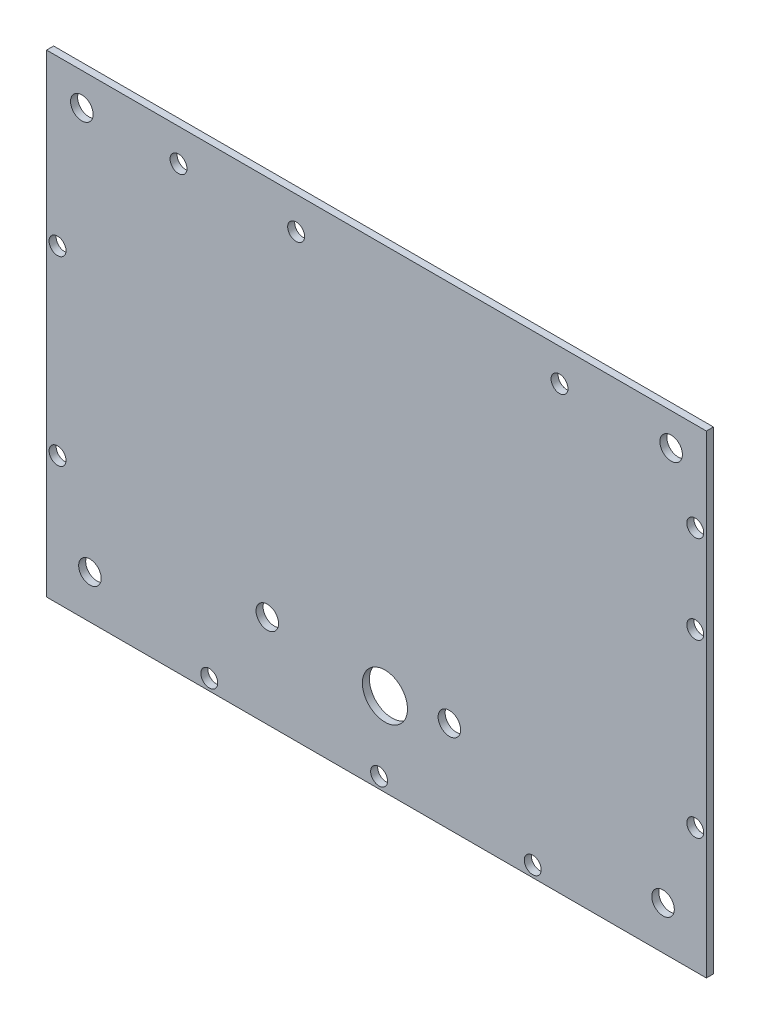
ISO-10303-21;
HEADER;
FILE_DESCRIPTION(('STEP AP214'),'2;1');
FILE_NAME('part.step','',(''),(''),'','','');
FILE_SCHEMA(('AUTOMOTIVE_DESIGN { 1 0 10303 214 1 1 1 1 }'));
ENDSEC;
DATA;
#1=APPLICATION_CONTEXT('core data for automotive mechanical design processes');
#2=APPLICATION_PROTOCOL_DEFINITION('international standard','automotive_design',2000,#1);
#3=PRODUCT_CONTEXT('',#1,'mechanical');
#4=PRODUCT('Part','Part','',(#3));
#5=PRODUCT_RELATED_PRODUCT_CATEGORY('part','',(#4));
#6=PRODUCT_DEFINITION_FORMATION('','',#4);
#7=PRODUCT_DEFINITION_CONTEXT('part definition',#1,'design');
#8=PRODUCT_DEFINITION('design','',#6,#7);
#9=PRODUCT_DEFINITION_SHAPE('','',#8);
#10=(LENGTH_UNIT() NAMED_UNIT(*) SI_UNIT(.MILLI.,.METRE.));
#11=(NAMED_UNIT(*) PLANE_ANGLE_UNIT() SI_UNIT($,.RADIAN.));
#12=(NAMED_UNIT(*) SI_UNIT($,.STERADIAN.) SOLID_ANGLE_UNIT());
#13=UNCERTAINTY_MEASURE_WITH_UNIT(LENGTH_MEASURE(1.E-05),#10,'distance_accuracy_value','');
#14=(GEOMETRIC_REPRESENTATION_CONTEXT(3) GLOBAL_UNCERTAINTY_ASSIGNED_CONTEXT((#13)) GLOBAL_UNIT_ASSIGNED_CONTEXT((#10,
#11,#12)) REPRESENTATION_CONTEXT('',''));
#15=CARTESIAN_POINT('',(0.,0.,0.));
#16=DIRECTION('',(0.,0.,1.));
#17=DIRECTION('',(1.,0.,0.));
#18=AXIS2_PLACEMENT_3D('',#15,#16,#17);
#19=CARTESIAN_POINT('',(74.295,-53.34,1.5875));
#20=DIRECTION('',(-1.,0.,0.));
#21=DIRECTION('',(0.,0.,1.));
#22=AXIS2_PLACEMENT_3D('',#19,#20,#21);
#23=PLANE('',#22);
#24=DIRECTION('',(0.,1.,0.));
#25=VECTOR('',#24,1.);
#26=CARTESIAN_POINT('',(74.295,-53.34,0.));
#27=LINE('',#26,#25);
#28=CARTESIAN_POINT('',(74.295,-53.34,0.));
#29=VERTEX_POINT('',#28);
#30=CARTESIAN_POINT('',(74.295,53.34,0.));
#31=VERTEX_POINT('',#30);
#32=EDGE_CURVE('E102',#29,#31,#27,.T.);
#33=ORIENTED_EDGE('',*,*,#32,.T.);
#34=DIRECTION('',(0.,0.,-1.));
#35=VECTOR('',#34,1.);
#36=CARTESIAN_POINT('',(74.295,53.34,1.5875));
#37=LINE('',#36,#35);
#38=CARTESIAN_POINT('',(74.295,53.34,1.5875));
#39=VERTEX_POINT('',#38);
#40=EDGE_CURVE('E11',#39,#31,#37,.T.);
#41=ORIENTED_EDGE('',*,*,#40,.F.);
#42=DIRECTION('',(0.,1.,0.));
#43=VECTOR('',#42,1.);
#44=CARTESIAN_POINT('',(74.295,-53.34,1.5875));
#45=LINE('',#44,#43);
#46=CARTESIAN_POINT('',(74.295,-53.34,1.5875));
#47=VERTEX_POINT('',#46);
#48=EDGE_CURVE('E90',#47,#39,#45,.T.);
#49=ORIENTED_EDGE('',*,*,#48,.F.);
#50=DIRECTION('',(0.,0.,-1.));
#51=VECTOR('',#50,1.);
#52=CARTESIAN_POINT('',(74.295,-53.34,1.5875));
#53=LINE('',#52,#51);
#54=EDGE_CURVE('E98',#47,#29,#53,.T.);
#55=ORIENTED_EDGE('',*,*,#54,.T.);
#56=EDGE_LOOP('',(#33,#41,#49,#55));
#57=FACE_BOUND('',#56,.T.);
#58=ADVANCED_FACE('F39',(#57),#23,.F.);
#59=CARTESIAN_POINT('',(-74.295,53.34,1.5875));
#60=DIRECTION('',(0.,-1.,0.));
#61=DIRECTION('',(0.,0.,-1.));
#62=AXIS2_PLACEMENT_3D('',#59,#60,#61);
#63=PLANE('',#62);
#64=DIRECTION('',(-1.,0.,0.));
#65=VECTOR('',#64,1.);
#66=CARTESIAN_POINT('',(-74.295,53.34,0.));
#67=LINE('',#66,#65);
#68=CARTESIAN_POINT('',(-74.295,53.34,0.));
#69=VERTEX_POINT('',#68);
#70=EDGE_CURVE('E94',#31,#69,#67,.T.);
#71=ORIENTED_EDGE('',*,*,#70,.T.);
#72=DIRECTION('',(0.,0.,-1.));
#73=VECTOR('',#72,1.);
#74=CARTESIAN_POINT('',(-74.295,53.34,1.5875));
#75=LINE('',#74,#73);
#76=CARTESIAN_POINT('',(-74.295,53.34,1.5875));
#77=VERTEX_POINT('',#76);
#78=EDGE_CURVE('E47',#77,#69,#75,.T.);
#79=ORIENTED_EDGE('',*,*,#78,.F.);
#80=DIRECTION('',(-1.,0.,0.));
#81=VECTOR('',#80,1.);
#82=CARTESIAN_POINT('',(-74.295,53.34,1.5875));
#83=LINE('',#82,#81);
#84=EDGE_CURVE('E85',#39,#77,#83,.T.);
#85=ORIENTED_EDGE('',*,*,#84,.F.);
#86=ORIENTED_EDGE('',*,*,#40,.T.);
#87=EDGE_LOOP('',(#71,#79,#85,#86));
#88=FACE_BOUND('',#87,.T.);
#89=ADVANCED_FACE('F93',(#88),#63,.F.);
#90=CARTESIAN_POINT('',(-74.295,-53.34,1.5875));
#91=DIRECTION('',(1.,0.,0.));
#92=DIRECTION('',(0.,0.,-1.));
#93=AXIS2_PLACEMENT_3D('',#90,#91,#92);
#94=PLANE('',#93);
#95=DIRECTION('',(0.,-1.,0.));
#96=VECTOR('',#95,1.);
#97=CARTESIAN_POINT('',(-74.295,-53.34,0.));
#98=LINE('',#97,#96);
#99=CARTESIAN_POINT('',(-74.295,-53.34,0.));
#100=VERTEX_POINT('',#99);
#101=EDGE_CURVE('E72',#69,#100,#98,.T.);
#102=ORIENTED_EDGE('',*,*,#101,.T.);
#103=DIRECTION('',(0.,0.,-1.));
#104=VECTOR('',#103,1.);
#105=CARTESIAN_POINT('',(-74.295,-53.34,1.5875));
#106=LINE('',#105,#104);
#107=CARTESIAN_POINT('',(-74.295,-53.34,1.5875));
#108=VERTEX_POINT('',#107);
#109=EDGE_CURVE('E95',#108,#100,#106,.T.);
#110=ORIENTED_EDGE('',*,*,#109,.F.);
#111=DIRECTION('',(0.,-1.,0.));
#112=VECTOR('',#111,1.);
#113=CARTESIAN_POINT('',(-74.295,-53.34,1.5875));
#114=LINE('',#113,#112);
#115=EDGE_CURVE('E88',#77,#108,#114,.T.);
#116=ORIENTED_EDGE('',*,*,#115,.F.);
#117=ORIENTED_EDGE('',*,*,#78,.T.);
#118=EDGE_LOOP('',(#102,#110,#116,#117));
#119=FACE_BOUND('',#118,.T.);
#120=ADVANCED_FACE('F96',(#119),#94,.F.);
#121=CARTESIAN_POINT('',(-74.295,-53.34,1.5875));
#122=DIRECTION('',(0.,1.,0.));
#123=DIRECTION('',(0.,0.,1.));
#124=AXIS2_PLACEMENT_3D('',#121,#122,#123);
#125=PLANE('',#124);
#126=DIRECTION('',(1.,0.,0.));
#127=VECTOR('',#126,1.);
#128=CARTESIAN_POINT('',(-74.295,-53.34,0.));
#129=LINE('',#128,#127);
#130=EDGE_CURVE('E78',#100,#29,#129,.T.);
#131=ORIENTED_EDGE('',*,*,#130,.T.);
#132=ORIENTED_EDGE('',*,*,#54,.F.);
#133=DIRECTION('',(1.,0.,0.));
#134=VECTOR('',#133,1.);
#135=CARTESIAN_POINT('',(-74.295,-53.34,1.5875));
#136=LINE('',#135,#134);
#137=EDGE_CURVE('E55',#108,#47,#136,.T.);
#138=ORIENTED_EDGE('',*,*,#137,.F.);
#139=ORIENTED_EDGE('',*,*,#109,.T.);
#140=EDGE_LOOP('',(#131,#132,#138,#139));
#141=FACE_BOUND('',#140,.T.);
#142=ADVANCED_FACE('F110',(#141),#125,.F.);
#143=CARTESIAN_POINT('',(0.,0.,1.5875));
#144=DIRECTION('',(0.,0.,-1.));
#145=DIRECTION('',(-1.,0.,0.));
#146=AXIS2_PLACEMENT_3D('',#143,#144,#145);
#147=PLANE('',#146);
#148=CARTESIAN_POINT('',(-24.5848329268184,-32.4093144095199,1.5875));
#149=DIRECTION('',(0.,0.,1.));
#150=DIRECTION('',(1.,0.,0.));
#151=AXIS2_PLACEMENT_3D('',#148,#149,#150);
#152=CIRCLE('',#151,2.54);
#153=CARTESIAN_POINT('',(-22.0448329268184,-32.4093144095199,1.5875));
#154=VERTEX_POINT('',#153);
#155=EDGE_CURVE('E156',#154,#154,#152,.T.);
#156=ORIENTED_EDGE('',*,*,#155,.F.);
#157=EDGE_LOOP('',(#156));
#158=FACE_BOUND('',#157,.T.);
#159=CARTESIAN_POINT('',(16.415053575909,-32.6176478408348,1.5875));
#160=DIRECTION('',(0.,0.,1.));
#161=DIRECTION('',(1.,0.,0.));
#162=AXIS2_PLACEMENT_3D('',#159,#160,#161);
#163=CIRCLE('',#162,2.54);
#164=CARTESIAN_POINT('',(18.955053575909,-32.6176478408348,1.5875));
#165=VERTEX_POINT('',#164);
#166=EDGE_CURVE('E215',#165,#165,#163,.T.);
#167=ORIENTED_EDGE('',*,*,#166,.F.);
#168=EDGE_LOOP('',(#167));
#169=FACE_BOUND('',#168,.T.);
#170=CARTESIAN_POINT('',(-71.823750006,16.3856887750996,1.5875));
#171=DIRECTION('',(0.,0.,1.));
#172=DIRECTION('',(1.,0.,0.));
#173=AXIS2_PLACEMENT_3D('',#170,#171,#172);
#174=CIRCLE('',#173,1.90499999999999);
#175=CARTESIAN_POINT('',(-69.918750006,16.3856887750996,1.5875));
#176=VERTEX_POINT('',#175);
#177=EDGE_CURVE('E155',#176,#176,#174,.T.);
#178=ORIENTED_EDGE('',*,*,#177,.F.);
#179=EDGE_LOOP('',(#178));
#180=FACE_BOUND('',#179,.T.);
#181=CARTESIAN_POINT('',(-71.823750006,-24.5174857949194,1.5875));
#182=DIRECTION('',(0.,0.,1.));
#183=DIRECTION('',(1.,0.,0.));
#184=AXIS2_PLACEMENT_3D('',#181,#182,#183);
#185=CIRCLE('',#184,1.90499999999999);
#186=CARTESIAN_POINT('',(-69.918750006,-24.5174857949194,1.5875));
#187=VERTEX_POINT('',#186);
#188=EDGE_CURVE('E162',#187,#187,#185,.T.);
#189=ORIENTED_EDGE('',*,*,#188,.F.);
#190=EDGE_LOOP('',(#189));
#191=FACE_BOUND('',#190,.T.);
#192=CARTESIAN_POINT('',(-37.6554621700565,-50.84,1.5875));
#193=DIRECTION('',(0.,0.,1.));
#194=DIRECTION('',(1.,0.,0.));
#195=AXIS2_PLACEMENT_3D('',#192,#193,#194);
#196=CIRCLE('',#195,1.905);
#197=CARTESIAN_POINT('',(-35.7504621700565,-50.84,1.5875));
#198=VERTEX_POINT('',#197);
#199=EDGE_CURVE('E168',#198,#198,#196,.T.);
#200=ORIENTED_EDGE('',*,*,#199,.F.);
#201=EDGE_LOOP('',(#200));
#202=FACE_BOUND('',#201,.T.);
#203=CARTESIAN_POINT('',(0.592258220454889,-50.84,1.5875));
#204=DIRECTION('',(0.,0.,1.));
#205=DIRECTION('',(1.,0.,0.));
#206=AXIS2_PLACEMENT_3D('',#203,#204,#205);
#207=CIRCLE('',#206,1.905);
#208=CARTESIAN_POINT('',(2.49725822045489,-50.84,1.5875));
#209=VERTEX_POINT('',#208);
#210=EDGE_CURVE('E174',#209,#209,#207,.T.);
#211=ORIENTED_EDGE('',*,*,#210,.F.);
#212=EDGE_LOOP('',(#211));
#213=FACE_BOUND('',#212,.T.);
#214=CARTESIAN_POINT('',(35.1973818774609,-50.84,1.5875));
#215=DIRECTION('',(0.,0.,1.));
#216=DIRECTION('',(1.,0.,0.));
#217=AXIS2_PLACEMENT_3D('',#214,#215,#216);
#218=CIRCLE('',#217,1.905);
#219=CARTESIAN_POINT('',(37.1023818774609,-50.84,1.5875));
#220=VERTEX_POINT('',#219);
#221=EDGE_CURVE('E180',#220,#220,#218,.T.);
#222=ORIENTED_EDGE('',*,*,#221,.F.);
#223=EDGE_LOOP('',(#222));
#224=FACE_BOUND('',#223,.T.);
#225=CARTESIAN_POINT('',(71.795,-25.2459068015326,1.5875));
#226=DIRECTION('',(0.,0.,1.));
#227=DIRECTION('',(1.,0.,0.));
#228=AXIS2_PLACEMENT_3D('',#225,#226,#227);
#229=CIRCLE('',#228,1.90500000000001);
#230=CARTESIAN_POINT('',(73.7,-25.2459068015326,1.5875));
#231=VERTEX_POINT('',#230);
#232=EDGE_CURVE('E186',#231,#231,#229,.T.);
#233=ORIENTED_EDGE('',*,*,#232,.F.);
#234=EDGE_LOOP('',(#233));
#235=FACE_BOUND('',#234,.T.);
#236=CARTESIAN_POINT('',(71.795,13.3752433604116,1.5875));
#237=DIRECTION('',(0.,0.,1.));
#238=DIRECTION('',(1.,0.,0.));
#239=AXIS2_PLACEMENT_3D('',#236,#237,#238);
#240=CIRCLE('',#239,1.90500000000001);
#241=CARTESIAN_POINT('',(73.7,13.3752433604116,1.5875));
#242=VERTEX_POINT('',#241);
#243=EDGE_CURVE('E192',#242,#242,#240,.T.);
#244=ORIENTED_EDGE('',*,*,#243,.F.);
#245=EDGE_LOOP('',(#244));
#246=FACE_BOUND('',#245,.T.);
#247=CARTESIAN_POINT('',(71.795,33.1996804154614,1.5875));
#248=DIRECTION('',(0.,0.,1.));
#249=DIRECTION('',(1.,0.,0.));
#250=AXIS2_PLACEMENT_3D('',#247,#248,#249);
#251=CIRCLE('',#250,1.90500000000001);
#252=CARTESIAN_POINT('',(73.7,33.1996804154614,1.5875));
#253=VERTEX_POINT('',#252);
#254=EDGE_CURVE('E198',#253,#253,#251,.T.);
#255=ORIENTED_EDGE('',*,*,#254,.F.);
#256=EDGE_LOOP('',(#255));
#257=FACE_BOUND('',#256,.T.);
#258=CARTESIAN_POINT('',(41.2226177446453,46.0169346163496,1.5875));
#259=DIRECTION('',(0.,0.,1.));
#260=DIRECTION('',(1.,0.,0.));
#261=AXIS2_PLACEMENT_3D('',#258,#259,#260);
#262=CIRCLE('',#261,1.905);
#263=CARTESIAN_POINT('',(43.1276177446453,46.0169346163496,1.5875));
#264=VERTEX_POINT('',#263);
#265=EDGE_CURVE('E204',#264,#264,#262,.T.);
#266=ORIENTED_EDGE('',*,*,#265,.F.);
#267=EDGE_LOOP('',(#266));
#268=FACE_BOUND('',#267,.T.);
#269=CARTESIAN_POINT('',(-18.0962742555855,46.0169346163496,1.5875));
#270=DIRECTION('',(0.,0.,1.));
#271=DIRECTION('',(1.,0.,0.));
#272=AXIS2_PLACEMENT_3D('',#269,#270,#271);
#273=CIRCLE('',#272,1.90500000000001);
#274=CARTESIAN_POINT('',(-16.1912742555854,46.0169346163496,1.5875));
#275=VERTEX_POINT('',#274);
#276=EDGE_CURVE('E149',#275,#275,#273,.T.);
#277=ORIENTED_EDGE('',*,*,#276,.F.);
#278=EDGE_LOOP('',(#277));
#279=FACE_BOUND('',#278,.T.);
#280=CARTESIAN_POINT('',(-44.5785823419475,46.0169346163496,1.5875));
#281=DIRECTION('',(0.,0.,1.));
#282=DIRECTION('',(1.,0.,0.));
#283=AXIS2_PLACEMENT_3D('',#280,#281,#282);
#284=CIRCLE('',#283,1.90500000000001);
#285=CARTESIAN_POINT('',(-42.6735823419475,46.0169346163496,1.5875));
#286=VERTEX_POINT('',#285);
#287=EDGE_CURVE('E143',#286,#286,#284,.T.);
#288=ORIENTED_EDGE('',*,*,#287,.F.);
#289=EDGE_LOOP('',(#288));
#290=FACE_BOUND('',#289,.T.);
#291=CARTESIAN_POINT('',(1.90499999999999,-34.544,1.5875));
#292=DIRECTION('',(0.,0.,1.));
#293=DIRECTION('',(1.,0.,0.));
#294=AXIS2_PLACEMENT_3D('',#291,#292,#293);
#295=CIRCLE('',#294,5.08);
#296=CARTESIAN_POINT('',(6.98499999999999,-34.544,1.5875));
#297=VERTEX_POINT('',#296);
#298=EDGE_CURVE('E137',#297,#297,#295,.T.);
#299=ORIENTED_EDGE('',*,*,#298,.F.);
#300=EDGE_LOOP('',(#299));
#301=FACE_BOUND('',#300,.T.);
#302=CARTESIAN_POINT('',(64.5325,-43.5775,1.5875));
#303=DIRECTION('',(0.,0.,1.));
#304=DIRECTION('',(-1.,0.,0.));
#305=AXIS2_PLACEMENT_3D('',#302,#303,#304);
#306=CIRCLE('',#305,2.54);
#307=CARTESIAN_POINT('',(61.9925,-43.5775,1.5875));
#308=VERTEX_POINT('',#307);
#309=EDGE_CURVE('E129',#308,#308,#306,.T.);
#310=ORIENTED_EDGE('',*,*,#309,.F.);
#311=EDGE_LOOP('',(#310));
#312=FACE_BOUND('',#311,.T.);
#313=CARTESIAN_POINT('',(-66.3575,46.0375,1.5875));
#314=DIRECTION('',(0.,0.,1.));
#315=DIRECTION('',(1.,0.,0.));
#316=AXIS2_PLACEMENT_3D('',#313,#314,#315);
#317=CIRCLE('',#316,2.54);
#318=CARTESIAN_POINT('',(-63.8175,46.0375,1.5875));
#319=VERTEX_POINT('',#318);
#320=EDGE_CURVE('E122',#319,#319,#317,.T.);
#321=ORIENTED_EDGE('',*,*,#320,.F.);
#322=EDGE_LOOP('',(#321));
#323=FACE_BOUND('',#322,.T.);
#324=CARTESIAN_POINT('',(66.3575,46.0375,1.5875));
#325=DIRECTION('',(0.,0.,1.));
#326=DIRECTION('',(-1.,0.,0.));
#327=AXIS2_PLACEMENT_3D('',#324,#325,#326);
#328=CIRCLE('',#327,2.54);
#329=CARTESIAN_POINT('',(63.8175,46.0375,1.5875));
#330=VERTEX_POINT('',#329);
#331=EDGE_CURVE('E134',#330,#330,#328,.T.);
#332=ORIENTED_EDGE('',*,*,#331,.F.);
#333=EDGE_LOOP('',(#332));
#334=FACE_BOUND('',#333,.T.);
#335=CARTESIAN_POINT('',(-64.5325,-43.5775,1.5875));
#336=DIRECTION('',(0.,0.,1.));
#337=DIRECTION('',(1.,0.,0.));
#338=AXIS2_PLACEMENT_3D('',#335,#336,#337);
#339=CIRCLE('',#338,2.54);
#340=CARTESIAN_POINT('',(-61.9925,-43.5775,1.5875));
#341=VERTEX_POINT('',#340);
#342=EDGE_CURVE('E116',#341,#341,#339,.T.);
#343=ORIENTED_EDGE('',*,*,#342,.F.);
#344=EDGE_LOOP('',(#343));
#345=FACE_BOUND('',#344,.T.);
#346=ORIENTED_EDGE('',*,*,#48,.T.);
#347=ORIENTED_EDGE('',*,*,#84,.T.);
#348=ORIENTED_EDGE('',*,*,#115,.T.);
#349=ORIENTED_EDGE('',*,*,#137,.T.);
#350=EDGE_LOOP('',(#346,#347,#348,#349));
#351=FACE_BOUND('',#350,.T.);
#352=ADVANCED_FACE('F86',(#158,#169,#180,#191,#202,#213,#224,#235,#246,#257,#268,#279,#290,#301,
#312,#323,#334,#345,#351),#147,.F.);
#353=CARTESIAN_POINT('',(0.,0.,0.));
#354=DIRECTION('',(0.,0.,-1.));
#355=DIRECTION('',(-1.,0.,0.));
#356=AXIS2_PLACEMENT_3D('',#353,#354,#355);
#357=PLANE('',#356);
#358=CARTESIAN_POINT('',(-24.5848329268184,-32.4093144095199,0.));
#359=DIRECTION('',(0.,0.,-1.));
#360=DIRECTION('',(-1.,0.,0.));
#361=AXIS2_PLACEMENT_3D('',#358,#359,#360);
#362=CIRCLE('',#361,2.54);
#363=CARTESIAN_POINT('',(-27.1248329268184,-32.4093144095199,0.));
#364=VERTEX_POINT('',#363);
#365=EDGE_CURVE('E218',#364,#364,#362,.F.);
#366=ORIENTED_EDGE('',*,*,#365,.T.);
#367=EDGE_LOOP('',(#366));
#368=FACE_BOUND('',#367,.T.);
#369=CARTESIAN_POINT('',(16.415053575909,-32.6176478408348,0.));
#370=DIRECTION('',(0.,0.,-1.));
#371=DIRECTION('',(-1.,0.,0.));
#372=AXIS2_PLACEMENT_3D('',#369,#370,#371);
#373=CIRCLE('',#372,2.54);
#374=CARTESIAN_POINT('',(13.875053575909,-32.6176478408348,0.));
#375=VERTEX_POINT('',#374);
#376=EDGE_CURVE('E212',#375,#375,#373,.F.);
#377=ORIENTED_EDGE('',*,*,#376,.T.);
#378=EDGE_LOOP('',(#377));
#379=FACE_BOUND('',#378,.T.);
#380=CARTESIAN_POINT('',(-71.823750006,16.3856887750996,0.));
#381=DIRECTION('',(0.,0.,-1.));
#382=DIRECTION('',(-1.,0.,0.));
#383=AXIS2_PLACEMENT_3D('',#380,#381,#382);
#384=CIRCLE('',#383,1.90499999999999);
#385=CARTESIAN_POINT('',(-73.7287500059999,16.3856887750996,0.));
#386=VERTEX_POINT('',#385);
#387=EDGE_CURVE('E152',#386,#386,#384,.F.);
#388=ORIENTED_EDGE('',*,*,#387,.T.);
#389=EDGE_LOOP('',(#388));
#390=FACE_BOUND('',#389,.T.);
#391=CARTESIAN_POINT('',(-71.823750006,-24.5174857949194,0.));
#392=DIRECTION('',(0.,0.,-1.));
#393=DIRECTION('',(-1.,0.,0.));
#394=AXIS2_PLACEMENT_3D('',#391,#392,#393);
#395=CIRCLE('',#394,1.90499999999999);
#396=CARTESIAN_POINT('',(-73.7287500059999,-24.5174857949194,0.));
#397=VERTEX_POINT('',#396);
#398=EDGE_CURVE('E159',#397,#397,#395,.F.);
#399=ORIENTED_EDGE('',*,*,#398,.T.);
#400=EDGE_LOOP('',(#399));
#401=FACE_BOUND('',#400,.T.);
#402=CARTESIAN_POINT('',(-37.6554621700565,-50.84,0.));
#403=DIRECTION('',(0.,0.,-1.));
#404=DIRECTION('',(-1.,0.,0.));
#405=AXIS2_PLACEMENT_3D('',#402,#403,#404);
#406=CIRCLE('',#405,1.905);
#407=CARTESIAN_POINT('',(-39.5604621700565,-50.84,0.));
#408=VERTEX_POINT('',#407);
#409=EDGE_CURVE('E165',#408,#408,#406,.F.);
#410=ORIENTED_EDGE('',*,*,#409,.T.);
#411=EDGE_LOOP('',(#410));
#412=FACE_BOUND('',#411,.T.);
#413=CARTESIAN_POINT('',(0.592258220454889,-50.84,0.));
#414=DIRECTION('',(0.,0.,-1.));
#415=DIRECTION('',(-1.,0.,0.));
#416=AXIS2_PLACEMENT_3D('',#413,#414,#415);
#417=CIRCLE('',#416,1.905);
#418=CARTESIAN_POINT('',(-1.31274177954512,-50.84,0.));
#419=VERTEX_POINT('',#418);
#420=EDGE_CURVE('E171',#419,#419,#417,.F.);
#421=ORIENTED_EDGE('',*,*,#420,.T.);
#422=EDGE_LOOP('',(#421));
#423=FACE_BOUND('',#422,.T.);
#424=CARTESIAN_POINT('',(35.1973818774609,-50.84,0.));
#425=DIRECTION('',(0.,0.,-1.));
#426=DIRECTION('',(-1.,0.,0.));
#427=AXIS2_PLACEMENT_3D('',#424,#425,#426);
#428=CIRCLE('',#427,1.905);
#429=CARTESIAN_POINT('',(33.2923818774609,-50.84,0.));
#430=VERTEX_POINT('',#429);
#431=EDGE_CURVE('E177',#430,#430,#428,.F.);
#432=ORIENTED_EDGE('',*,*,#431,.T.);
#433=EDGE_LOOP('',(#432));
#434=FACE_BOUND('',#433,.T.);
#435=CARTESIAN_POINT('',(71.795,-25.2459068015326,0.));
#436=DIRECTION('',(0.,0.,-1.));
#437=DIRECTION('',(-1.,0.,0.));
#438=AXIS2_PLACEMENT_3D('',#435,#436,#437);
#439=CIRCLE('',#438,1.90500000000001);
#440=CARTESIAN_POINT('',(69.89,-25.2459068015326,0.));
#441=VERTEX_POINT('',#440);
#442=EDGE_CURVE('E183',#441,#441,#439,.F.);
#443=ORIENTED_EDGE('',*,*,#442,.T.);
#444=EDGE_LOOP('',(#443));
#445=FACE_BOUND('',#444,.T.);
#446=CARTESIAN_POINT('',(71.795,13.3752433604116,0.));
#447=DIRECTION('',(0.,0.,-1.));
#448=DIRECTION('',(-1.,0.,0.));
#449=AXIS2_PLACEMENT_3D('',#446,#447,#448);
#450=CIRCLE('',#449,1.90500000000001);
#451=CARTESIAN_POINT('',(69.89,13.3752433604116,0.));
#452=VERTEX_POINT('',#451);
#453=EDGE_CURVE('E189',#452,#452,#450,.F.);
#454=ORIENTED_EDGE('',*,*,#453,.T.);
#455=EDGE_LOOP('',(#454));
#456=FACE_BOUND('',#455,.T.);
#457=CARTESIAN_POINT('',(71.795,33.1996804154614,0.));
#458=DIRECTION('',(0.,0.,-1.));
#459=DIRECTION('',(-1.,0.,0.));
#460=AXIS2_PLACEMENT_3D('',#457,#458,#459);
#461=CIRCLE('',#460,1.90500000000001);
#462=CARTESIAN_POINT('',(69.89,33.1996804154614,0.));
#463=VERTEX_POINT('',#462);
#464=EDGE_CURVE('E195',#463,#463,#461,.F.);
#465=ORIENTED_EDGE('',*,*,#464,.T.);
#466=EDGE_LOOP('',(#465));
#467=FACE_BOUND('',#466,.T.);
#468=CARTESIAN_POINT('',(41.2226177446453,46.0169346163496,0.));
#469=DIRECTION('',(0.,0.,-1.));
#470=DIRECTION('',(-1.,0.,0.));
#471=AXIS2_PLACEMENT_3D('',#468,#469,#470);
#472=CIRCLE('',#471,1.905);
#473=CARTESIAN_POINT('',(39.3176177446453,46.0169346163496,0.));
#474=VERTEX_POINT('',#473);
#475=EDGE_CURVE('E201',#474,#474,#472,.F.);
#476=ORIENTED_EDGE('',*,*,#475,.T.);
#477=EDGE_LOOP('',(#476));
#478=FACE_BOUND('',#477,.T.);
#479=CARTESIAN_POINT('',(-18.0962742555855,46.0169346163496,0.));
#480=DIRECTION('',(0.,0.,-1.));
#481=DIRECTION('',(-1.,0.,0.));
#482=AXIS2_PLACEMENT_3D('',#479,#480,#481);
#483=CIRCLE('',#482,1.90500000000001);
#484=CARTESIAN_POINT('',(-20.0012742555855,46.0169346163496,0.));
#485=VERTEX_POINT('',#484);
#486=EDGE_CURVE('E207',#485,#485,#483,.F.);
#487=ORIENTED_EDGE('',*,*,#486,.T.);
#488=EDGE_LOOP('',(#487));
#489=FACE_BOUND('',#488,.T.);
#490=CARTESIAN_POINT('',(-44.5785823419475,46.0169346163496,0.));
#491=DIRECTION('',(0.,0.,-1.));
#492=DIRECTION('',(-1.,0.,0.));
#493=AXIS2_PLACEMENT_3D('',#490,#491,#492);
#494=CIRCLE('',#493,1.90500000000001);
#495=CARTESIAN_POINT('',(-46.4835823419475,46.0169346163496,0.));
#496=VERTEX_POINT('',#495);
#497=EDGE_CURVE('E146',#496,#496,#494,.F.);
#498=ORIENTED_EDGE('',*,*,#497,.T.);
#499=EDGE_LOOP('',(#498));
#500=FACE_BOUND('',#499,.T.);
#501=CARTESIAN_POINT('',(1.90499999999999,-34.544,0.));
#502=DIRECTION('',(0.,0.,-1.));
#503=DIRECTION('',(-1.,0.,0.));
#504=AXIS2_PLACEMENT_3D('',#501,#502,#503);
#505=CIRCLE('',#504,5.08);
#506=CARTESIAN_POINT('',(-3.17500000000001,-34.544,0.));
#507=VERTEX_POINT('',#506);
#508=EDGE_CURVE('E140',#507,#507,#505,.F.);
#509=ORIENTED_EDGE('',*,*,#508,.T.);
#510=EDGE_LOOP('',(#509));
#511=FACE_BOUND('',#510,.T.);
#512=CARTESIAN_POINT('',(64.5325,-43.5775,0.));
#513=DIRECTION('',(0.,0.,1.));
#514=DIRECTION('',(-1.,0.,0.));
#515=AXIS2_PLACEMENT_3D('',#512,#513,#514);
#516=CIRCLE('',#515,2.54);
#517=CARTESIAN_POINT('',(61.9925,-43.5775,0.));
#518=VERTEX_POINT('',#517);
#519=EDGE_CURVE('E119',#518,#518,#516,.T.);
#520=ORIENTED_EDGE('',*,*,#519,.T.);
#521=EDGE_LOOP('',(#520));
#522=FACE_BOUND('',#521,.T.);
#523=CARTESIAN_POINT('',(-66.3575,46.0375,0.));
#524=DIRECTION('',(0.,0.,1.));
#525=DIRECTION('',(1.,0.,0.));
#526=AXIS2_PLACEMENT_3D('',#523,#524,#525);
#527=CIRCLE('',#526,2.54);
#528=CARTESIAN_POINT('',(-63.8175,46.0375,0.));
#529=VERTEX_POINT('',#528);
#530=EDGE_CURVE('E125',#529,#529,#527,.T.);
#531=ORIENTED_EDGE('',*,*,#530,.T.);
#532=EDGE_LOOP('',(#531));
#533=FACE_BOUND('',#532,.T.);
#534=CARTESIAN_POINT('',(66.3575,46.0375,0.));
#535=DIRECTION('',(0.,0.,1.));
#536=DIRECTION('',(-1.,0.,0.));
#537=AXIS2_PLACEMENT_3D('',#534,#535,#536);
#538=CIRCLE('',#537,2.54);
#539=CARTESIAN_POINT('',(63.8175,46.0375,0.));
#540=VERTEX_POINT('',#539);
#541=EDGE_CURVE('E126',#540,#540,#538,.T.);
#542=ORIENTED_EDGE('',*,*,#541,.T.);
#543=EDGE_LOOP('',(#542));
#544=FACE_BOUND('',#543,.T.);
#545=CARTESIAN_POINT('',(-64.5325,-43.5775,0.));
#546=DIRECTION('',(0.,0.,1.));
#547=DIRECTION('',(1.,0.,0.));
#548=AXIS2_PLACEMENT_3D('',#545,#546,#547);
#549=CIRCLE('',#548,2.54);
#550=CARTESIAN_POINT('',(-61.9925,-43.5775,0.));
#551=VERTEX_POINT('',#550);
#552=EDGE_CURVE('E105',#551,#551,#549,.T.);
#553=ORIENTED_EDGE('',*,*,#552,.T.);
#554=EDGE_LOOP('',(#553));
#555=FACE_BOUND('',#554,.T.);
#556=ORIENTED_EDGE('',*,*,#32,.F.);
#557=ORIENTED_EDGE('',*,*,#130,.F.);
#558=ORIENTED_EDGE('',*,*,#101,.F.);
#559=ORIENTED_EDGE('',*,*,#70,.F.);
#560=EDGE_LOOP('',(#556,#557,#558,#559));
#561=FACE_BOUND('',#560,.T.);
#562=ADVANCED_FACE('F113',(#368,#379,#390,#401,#412,#423,#434,#445,#456,#467,#478,#489,#500,
#511,#522,#533,#544,#555,#561),#357,.T.);
#563=CARTESIAN_POINT('',(-64.5325,-43.5775,0.));
#564=DIRECTION('',(0.,0.,1.));
#565=DIRECTION('',(1.,0.,0.));
#566=AXIS2_PLACEMENT_3D('',#563,#564,#565);
#567=CYLINDRICAL_SURFACE('',#566,2.54);
#568=ORIENTED_EDGE('',*,*,#552,.F.);
#569=EDGE_LOOP('',(#568));
#570=FACE_BOUND('',#569,.T.);
#571=ORIENTED_EDGE('',*,*,#342,.T.);
#572=EDGE_LOOP('',(#571));
#573=FACE_BOUND('',#572,.T.);
#574=ADVANCED_FACE('F263',(#570,#573),#567,.F.);
#575=CARTESIAN_POINT('',(66.3575,46.0375,0.));
#576=DIRECTION('',(0.,0.,1.));
#577=DIRECTION('',(1.,0.,0.));
#578=AXIS2_PLACEMENT_3D('',#575,#576,#577);
#579=CYLINDRICAL_SURFACE('',#578,2.54);
#580=ORIENTED_EDGE('',*,*,#541,.F.);
#581=EDGE_LOOP('',(#580));
#582=FACE_BOUND('',#581,.T.);
#583=ORIENTED_EDGE('',*,*,#331,.T.);
#584=EDGE_LOOP('',(#583));
#585=FACE_BOUND('',#584,.T.);
#586=ADVANCED_FACE('F265',(#582,#585),#579,.F.);
#587=CARTESIAN_POINT('',(-66.3575,46.0375,0.));
#588=DIRECTION('',(0.,0.,1.));
#589=DIRECTION('',(1.,0.,0.));
#590=AXIS2_PLACEMENT_3D('',#587,#588,#589);
#591=CYLINDRICAL_SURFACE('',#590,2.54);
#592=ORIENTED_EDGE('',*,*,#530,.F.);
#593=EDGE_LOOP('',(#592));
#594=FACE_BOUND('',#593,.T.);
#595=ORIENTED_EDGE('',*,*,#320,.T.);
#596=EDGE_LOOP('',(#595));
#597=FACE_BOUND('',#596,.T.);
#598=ADVANCED_FACE('F272',(#594,#597),#591,.F.);
#599=CARTESIAN_POINT('',(64.5325,-43.5775,0.));
#600=DIRECTION('',(0.,0.,1.));
#601=DIRECTION('',(1.,0.,0.));
#602=AXIS2_PLACEMENT_3D('',#599,#600,#601);
#603=CYLINDRICAL_SURFACE('',#602,2.54);
#604=ORIENTED_EDGE('',*,*,#519,.F.);
#605=EDGE_LOOP('',(#604));
#606=FACE_BOUND('',#605,.T.);
#607=ORIENTED_EDGE('',*,*,#309,.T.);
#608=EDGE_LOOP('',(#607));
#609=FACE_BOUND('',#608,.T.);
#610=ADVANCED_FACE('F377',(#606,#609),#603,.F.);
#611=CARTESIAN_POINT('',(1.90499999999999,-34.544,-0.000999999999999916));
#612=DIRECTION('',(0.,0.,1.));
#613=DIRECTION('',(1.,0.,0.));
#614=AXIS2_PLACEMENT_3D('',#611,#612,#613);
#615=CYLINDRICAL_SURFACE('',#614,5.08);
#616=ORIENTED_EDGE('',*,*,#508,.F.);
#617=EDGE_LOOP('',(#616));
#618=FACE_BOUND('',#617,.T.);
#619=ORIENTED_EDGE('',*,*,#298,.T.);
#620=EDGE_LOOP('',(#619));
#621=FACE_BOUND('',#620,.T.);
#622=ADVANCED_FACE('F374',(#618,#621),#615,.F.);
#623=CARTESIAN_POINT('',(-44.5785823419475,46.0169346163496,-0.000999999999999916));
#624=DIRECTION('',(0.,0.,1.));
#625=DIRECTION('',(1.,0.,0.));
#626=AXIS2_PLACEMENT_3D('',#623,#624,#625);
#627=CYLINDRICAL_SURFACE('',#626,1.90500000000001);
#628=ORIENTED_EDGE('',*,*,#497,.F.);
#629=EDGE_LOOP('',(#628));
#630=FACE_BOUND('',#629,.T.);
#631=ORIENTED_EDGE('',*,*,#287,.T.);
#632=EDGE_LOOP('',(#631));
#633=FACE_BOUND('',#632,.T.);
#634=ADVANCED_FACE('F337',(#630,#633),#627,.F.);
#635=CARTESIAN_POINT('',(-18.0962742555855,46.0169346163496,-0.000999999999999916));
#636=DIRECTION('',(0.,0.,1.));
#637=DIRECTION('',(1.,0.,0.));
#638=AXIS2_PLACEMENT_3D('',#635,#636,#637);
#639=CYLINDRICAL_SURFACE('',#638,1.90500000000001);
#640=ORIENTED_EDGE('',*,*,#486,.F.);
#641=EDGE_LOOP('',(#640));
#642=FACE_BOUND('',#641,.T.);
#643=ORIENTED_EDGE('',*,*,#276,.T.);
#644=EDGE_LOOP('',(#643));
#645=FACE_BOUND('',#644,.T.);
#646=ADVANCED_FACE('F333',(#642,#645),#639,.F.);
#647=CARTESIAN_POINT('',(41.2226177446453,46.0169346163496,-0.000999999999999916));
#648=DIRECTION('',(0.,0.,1.));
#649=DIRECTION('',(1.,0.,0.));
#650=AXIS2_PLACEMENT_3D('',#647,#648,#649);
#651=CYLINDRICAL_SURFACE('',#650,1.905);
#652=ORIENTED_EDGE('',*,*,#475,.F.);
#653=EDGE_LOOP('',(#652));
#654=FACE_BOUND('',#653,.T.);
#655=ORIENTED_EDGE('',*,*,#265,.T.);
#656=EDGE_LOOP('',(#655));
#657=FACE_BOUND('',#656,.T.);
#658=ADVANCED_FACE('F336',(#654,#657),#651,.F.);
#659=CARTESIAN_POINT('',(71.795,33.1996804154614,-0.000999999999999916));
#660=DIRECTION('',(0.,0.,1.));
#661=DIRECTION('',(1.,0.,0.));
#662=AXIS2_PLACEMENT_3D('',#659,#660,#661);
#663=CYLINDRICAL_SURFACE('',#662,1.90500000000001);
#664=ORIENTED_EDGE('',*,*,#464,.F.);
#665=EDGE_LOOP('',(#664));
#666=FACE_BOUND('',#665,.T.);
#667=ORIENTED_EDGE('',*,*,#254,.T.);
#668=EDGE_LOOP('',(#667));
#669=FACE_BOUND('',#668,.T.);
#670=ADVANCED_FACE('F341',(#666,#669),#663,.F.);
#671=CARTESIAN_POINT('',(71.795,13.3752433604116,-0.000999999999999916));
#672=DIRECTION('',(0.,0.,1.));
#673=DIRECTION('',(1.,0.,0.));
#674=AXIS2_PLACEMENT_3D('',#671,#672,#673);
#675=CYLINDRICAL_SURFACE('',#674,1.90500000000001);
#676=ORIENTED_EDGE('',*,*,#453,.F.);
#677=EDGE_LOOP('',(#676));
#678=FACE_BOUND('',#677,.T.);
#679=ORIENTED_EDGE('',*,*,#243,.T.);
#680=EDGE_LOOP('',(#679));
#681=FACE_BOUND('',#680,.T.);
#682=ADVANCED_FACE('F345',(#678,#681),#675,.F.);
#683=CARTESIAN_POINT('',(71.795,-25.2459068015326,-0.000999999999999916));
#684=DIRECTION('',(0.,0.,1.));
#685=DIRECTION('',(1.,0.,0.));
#686=AXIS2_PLACEMENT_3D('',#683,#684,#685);
#687=CYLINDRICAL_SURFACE('',#686,1.90500000000001);
#688=ORIENTED_EDGE('',*,*,#442,.F.);
#689=EDGE_LOOP('',(#688));
#690=FACE_BOUND('',#689,.T.);
#691=ORIENTED_EDGE('',*,*,#232,.T.);
#692=EDGE_LOOP('',(#691));
#693=FACE_BOUND('',#692,.T.);
#694=ADVANCED_FACE('F349',(#690,#693),#687,.F.);
#695=CARTESIAN_POINT('',(35.1973818774609,-50.84,-0.000999999999999916));
#696=DIRECTION('',(0.,0.,1.));
#697=DIRECTION('',(1.,0.,0.));
#698=AXIS2_PLACEMENT_3D('',#695,#696,#697);
#699=CYLINDRICAL_SURFACE('',#698,1.905);
#700=ORIENTED_EDGE('',*,*,#431,.F.);
#701=EDGE_LOOP('',(#700));
#702=FACE_BOUND('',#701,.T.);
#703=ORIENTED_EDGE('',*,*,#221,.T.);
#704=EDGE_LOOP('',(#703));
#705=FACE_BOUND('',#704,.T.);
#706=ADVANCED_FACE('F353',(#702,#705),#699,.F.);
#707=CARTESIAN_POINT('',(0.592258220454889,-50.84,-0.000999999999999916));
#708=DIRECTION('',(0.,0.,1.));
#709=DIRECTION('',(1.,0.,0.));
#710=AXIS2_PLACEMENT_3D('',#707,#708,#709);
#711=CYLINDRICAL_SURFACE('',#710,1.905);
#712=ORIENTED_EDGE('',*,*,#420,.F.);
#713=EDGE_LOOP('',(#712));
#714=FACE_BOUND('',#713,.T.);
#715=ORIENTED_EDGE('',*,*,#210,.T.);
#716=EDGE_LOOP('',(#715));
#717=FACE_BOUND('',#716,.T.);
#718=ADVANCED_FACE('F357',(#714,#717),#711,.F.);
#719=CARTESIAN_POINT('',(-37.6554621700565,-50.84,-0.000999999999999916));
#720=DIRECTION('',(0.,0.,1.));
#721=DIRECTION('',(1.,0.,0.));
#722=AXIS2_PLACEMENT_3D('',#719,#720,#721);
#723=CYLINDRICAL_SURFACE('',#722,1.905);
#724=ORIENTED_EDGE('',*,*,#409,.F.);
#725=EDGE_LOOP('',(#724));
#726=FACE_BOUND('',#725,.T.);
#727=ORIENTED_EDGE('',*,*,#199,.T.);
#728=EDGE_LOOP('',(#727));
#729=FACE_BOUND('',#728,.T.);
#730=ADVANCED_FACE('F361',(#726,#729),#723,.F.);
#731=CARTESIAN_POINT('',(-71.823750006,-24.5174857949194,-0.000999999999999916));
#732=DIRECTION('',(0.,0.,1.));
#733=DIRECTION('',(1.,0.,0.));
#734=AXIS2_PLACEMENT_3D('',#731,#732,#733);
#735=CYLINDRICAL_SURFACE('',#734,1.90499999999999);
#736=ORIENTED_EDGE('',*,*,#398,.F.);
#737=EDGE_LOOP('',(#736));
#738=FACE_BOUND('',#737,.T.);
#739=ORIENTED_EDGE('',*,*,#188,.T.);
#740=EDGE_LOOP('',(#739));
#741=FACE_BOUND('',#740,.T.);
#742=ADVANCED_FACE('F365',(#738,#741),#735,.F.);
#743=CARTESIAN_POINT('',(-71.823750006,16.3856887750996,-0.000999999999999916));
#744=DIRECTION('',(0.,0.,1.));
#745=DIRECTION('',(1.,0.,0.));
#746=AXIS2_PLACEMENT_3D('',#743,#744,#745);
#747=CYLINDRICAL_SURFACE('',#746,1.90499999999999);
#748=ORIENTED_EDGE('',*,*,#387,.F.);
#749=EDGE_LOOP('',(#748));
#750=FACE_BOUND('',#749,.T.);
#751=ORIENTED_EDGE('',*,*,#177,.T.);
#752=EDGE_LOOP('',(#751));
#753=FACE_BOUND('',#752,.T.);
#754=ADVANCED_FACE('F315',(#750,#753),#747,.F.);
#755=CARTESIAN_POINT('',(16.415053575909,-32.6176478408348,-0.000999999999999916));
#756=DIRECTION('',(0.,0.,1.));
#757=DIRECTION('',(1.,0.,0.));
#758=AXIS2_PLACEMENT_3D('',#755,#756,#757);
#759=CYLINDRICAL_SURFACE('',#758,2.54);
#760=ORIENTED_EDGE('',*,*,#376,.F.);
#761=EDGE_LOOP('',(#760));
#762=FACE_BOUND('',#761,.T.);
#763=ORIENTED_EDGE('',*,*,#166,.T.);
#764=EDGE_LOOP('',(#763));
#765=FACE_BOUND('',#764,.T.);
#766=ADVANCED_FACE('F310',(#762,#765),#759,.F.);
#767=CARTESIAN_POINT('',(-24.5848329268184,-32.4093144095199,-0.000999999999999916));
#768=DIRECTION('',(0.,0.,1.));
#769=DIRECTION('',(1.,0.,0.));
#770=AXIS2_PLACEMENT_3D('',#767,#768,#769);
#771=CYLINDRICAL_SURFACE('',#770,2.54);
#772=ORIENTED_EDGE('',*,*,#365,.F.);
#773=EDGE_LOOP('',(#772));
#774=FACE_BOUND('',#773,.T.);
#775=ORIENTED_EDGE('',*,*,#155,.T.);
#776=EDGE_LOOP('',(#775));
#777=FACE_BOUND('',#776,.T.);
#778=ADVANCED_FACE('F224',(#774,#777),#771,.F.);
#779=CLOSED_SHELL('',(#58,#89,#120,#142,#352,#562,#574,#586,#598,#610,#622,#634,#646,#658,#670,
#682,#694,#706,#718,#730,#742,#754,#766,#778));
#780=MANIFOLD_SOLID_BREP('B2',#779);
#781=ADVANCED_BREP_SHAPE_REPRESENTATION('',(#18,#780),#14);
#782=SHAPE_DEFINITION_REPRESENTATION(#9,#781);
ENDSEC;
END-ISO-10303-21;
